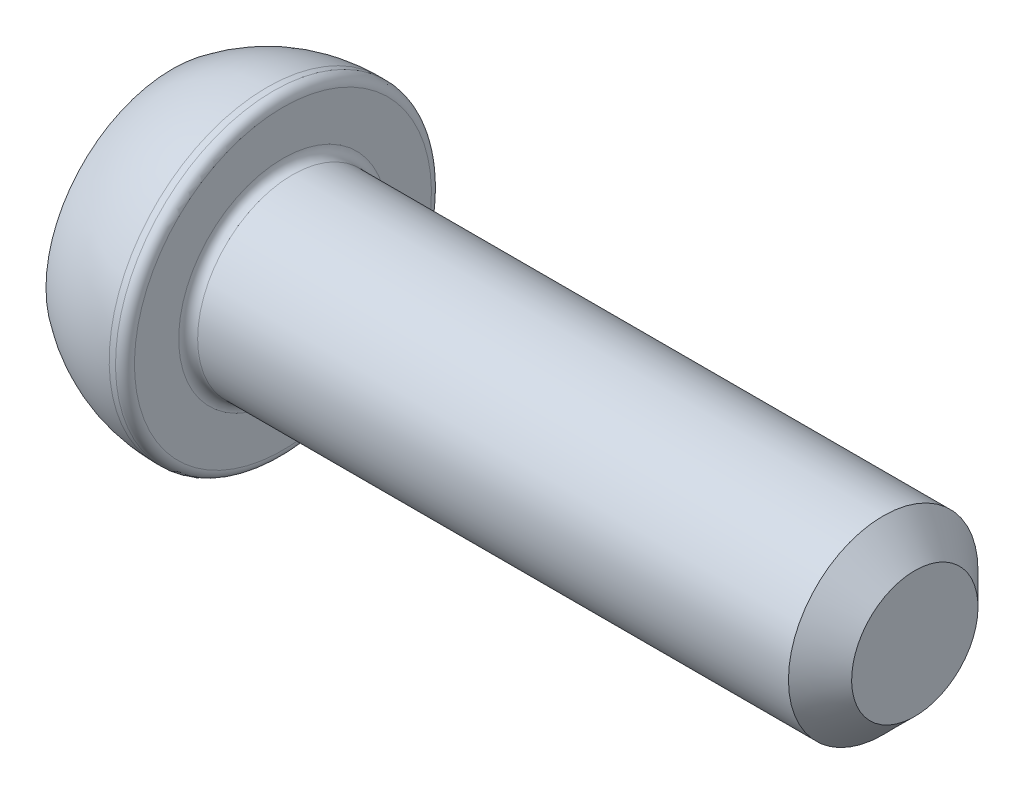
ISO-10303-21;
HEADER;
FILE_DESCRIPTION(('STEP AP214'),'2;1');
FILE_NAME('part.step','',(''),(''),'','','');
FILE_SCHEMA(('AUTOMOTIVE_DESIGN { 1 0 10303 214 1 1 1 1 }'));
ENDSEC;
DATA;
#1=APPLICATION_CONTEXT('core data for automotive mechanical design processes');
#2=APPLICATION_PROTOCOL_DEFINITION('international standard','automotive_design',2000,#1);
#3=PRODUCT_CONTEXT('',#1,'mechanical');
#4=PRODUCT('Part','Part','',(#3));
#5=PRODUCT_RELATED_PRODUCT_CATEGORY('part','',(#4));
#6=PRODUCT_DEFINITION_FORMATION('','',#4);
#7=PRODUCT_DEFINITION_CONTEXT('part definition',#1,'design');
#8=PRODUCT_DEFINITION('design','',#6,#7);
#9=PRODUCT_DEFINITION_SHAPE('','',#8);
#10=(LENGTH_UNIT() NAMED_UNIT(*) SI_UNIT(.MILLI.,.METRE.));
#11=(NAMED_UNIT(*) PLANE_ANGLE_UNIT() SI_UNIT($,.RADIAN.));
#12=(NAMED_UNIT(*) SI_UNIT($,.STERADIAN.) SOLID_ANGLE_UNIT());
#13=UNCERTAINTY_MEASURE_WITH_UNIT(LENGTH_MEASURE(1.E-05),#10,'distance_accuracy_value','');
#14=(GEOMETRIC_REPRESENTATION_CONTEXT(3) GLOBAL_UNCERTAINTY_ASSIGNED_CONTEXT((#13)) GLOBAL_UNIT_ASSIGNED_CONTEXT((#10,
#11,#12)) REPRESENTATION_CONTEXT('',''));
#15=CARTESIAN_POINT('',(0.,0.,0.));
#16=DIRECTION('',(0.,0.,1.));
#17=DIRECTION('',(1.,0.,0.));
#18=AXIS2_PLACEMENT_3D('',#15,#16,#17);
#19=CARTESIAN_POINT('',(0.,0.,0.));
#20=DIRECTION('',(-1.,0.,0.));
#21=DIRECTION('',(0.,-1.,0.));
#22=AXIS2_PLACEMENT_3D('',#19,#20,#21);
#23=PLANE('',#22);
#24=DIRECTION('',(0.,0.866025403784438,-0.5));
#25=VECTOR('',#24,1.);
#26=CARTESIAN_POINT('',(0.,0.,2.3094010767585));
#27=LINE('',#26,#25);
#28=CARTESIAN_POINT('',(0.,0.,2.3094010767585));
#29=VERTEX_POINT('',#28);
#30=CARTESIAN_POINT('',(0.,2.,1.15470053837925));
#31=VERTEX_POINT('',#30);
#32=EDGE_CURVE('E54',#29,#31,#27,.T.);
#33=ORIENTED_EDGE('',*,*,#32,.F.);
#34=DIRECTION('',(0.,0.866025403784439,0.5));
#35=VECTOR('',#34,1.);
#36=CARTESIAN_POINT('',(0.,-2.,1.15470053837925));
#37=LINE('',#36,#35);
#38=CARTESIAN_POINT('',(0.,-2.,1.15470053837925));
#39=VERTEX_POINT('',#38);
#40=EDGE_CURVE('E137',#39,#29,#37,.T.);
#41=ORIENTED_EDGE('',*,*,#40,.F.);
#42=DIRECTION('',(0.,0.,1.));
#43=VECTOR('',#42,1.);
#44=CARTESIAN_POINT('',(0.,-2.,-1.15470053837925));
#45=LINE('',#44,#43);
#46=CARTESIAN_POINT('',(0.,-2.,-1.15470053837925));
#47=VERTEX_POINT('',#46);
#48=EDGE_CURVE('E135',#47,#39,#45,.T.);
#49=ORIENTED_EDGE('',*,*,#48,.F.);
#50=DIRECTION('',(0.,-0.866025403784439,0.5));
#51=VECTOR('',#50,1.);
#52=CARTESIAN_POINT('',(0.,0.,-2.3094010767585));
#53=LINE('',#52,#51);
#54=CARTESIAN_POINT('',(0.,0.,-2.3094010767585));
#55=VERTEX_POINT('',#54);
#56=EDGE_CURVE('E102',#55,#47,#53,.T.);
#57=ORIENTED_EDGE('',*,*,#56,.F.);
#58=DIRECTION('',(0.,-0.866025403784439,-0.5));
#59=VECTOR('',#58,1.);
#60=CARTESIAN_POINT('',(0.,2.,-1.15470053837925));
#61=LINE('',#60,#59);
#62=CARTESIAN_POINT('',(0.,2.,-1.15470053837925));
#63=VERTEX_POINT('',#62);
#64=EDGE_CURVE('E131',#63,#55,#61,.T.);
#65=ORIENTED_EDGE('',*,*,#64,.F.);
#66=DIRECTION('',(0.,0.,-1.));
#67=VECTOR('',#66,1.);
#68=CARTESIAN_POINT('',(0.,2.,1.15470053837925));
#69=LINE('',#68,#67);
#70=EDGE_CURVE('E128',#31,#63,#69,.T.);
#71=ORIENTED_EDGE('',*,*,#70,.F.);
#72=EDGE_LOOP('',(#33,#41,#49,#57,#65,#71));
#73=FACE_BOUND('',#72,.T.);
#74=CARTESIAN_POINT('',(0.,0.,0.));
#75=DIRECTION('',(1.,0.,0.));
#76=DIRECTION('',(0.,1.,0.));
#77=AXIS2_PLACEMENT_3D('',#74,#75,#76);
#78=CIRCLE('',#77,4.);
#79=CARTESIAN_POINT('',(0.,4.,0.));
#80=VERTEX_POINT('',#79);
#81=EDGE_CURVE('E149',#80,#80,#78,.T.);
#82=ORIENTED_EDGE('',*,*,#81,.F.);
#83=EDGE_LOOP('',(#82));
#84=FACE_BOUND('',#83,.T.);
#85=ADVANCED_FACE('F38',(#73,#84),#23,.T.);
#86=CARTESIAN_POINT('',(3.,0.,0.));
#87=DIRECTION('',(1.,0.,0.));
#88=DIRECTION('',(0.,1.,0.));
#89=AXIS2_PLACEMENT_3D('',#86,#87,#88);
#90=SPHERICAL_SURFACE('',#89,5.);
#91=ORIENTED_EDGE('',*,*,#81,.T.);
#92=EDGE_LOOP('',(#91));
#93=FACE_BOUND('',#92,.T.);
#94=CARTESIAN_POINT('',(3.,0.,0.));
#95=DIRECTION('',(1.,0.,0.));
#96=DIRECTION('',(0.,1.,0.));
#97=AXIS2_PLACEMENT_3D('',#94,#95,#96);
#98=CIRCLE('',#97,5.);
#99=CARTESIAN_POINT('',(3.,5.,0.));
#100=VERTEX_POINT('',#99);
#101=EDGE_CURVE('E141',#100,#100,#98,.T.);
#102=ORIENTED_EDGE('',*,*,#101,.F.);
#103=EDGE_LOOP('',(#102));
#104=FACE_BOUND('',#103,.T.);
#105=ADVANCED_FACE('F178',(#93,#104),#90,.T.);
#106=CARTESIAN_POINT('',(23.5,0.,0.));
#107=DIRECTION('',(1.,0.,0.));
#108=DIRECTION('',(0.,1.,0.));
#109=AXIS2_PLACEMENT_3D('',#106,#107,#108);
#110=CYLINDRICAL_SURFACE('',#109,5.);
#111=CARTESIAN_POINT('',(3.2,0.,0.));
#112=DIRECTION('',(1.,0.,0.));
#113=DIRECTION('',(0.,1.,0.));
#114=AXIS2_PLACEMENT_3D('',#111,#112,#113);
#115=CIRCLE('',#114,5.);
#116=CARTESIAN_POINT('',(3.2,5.,0.));
#117=VERTEX_POINT('',#116);
#118=EDGE_CURVE('E161',#117,#117,#115,.F.);
#119=ORIENTED_EDGE('',*,*,#118,.T.);
#120=EDGE_LOOP('',(#119));
#121=FACE_BOUND('',#120,.T.);
#122=ORIENTED_EDGE('',*,*,#101,.T.);
#123=EDGE_LOOP('',(#122));
#124=FACE_BOUND('',#123,.T.);
#125=ADVANCED_FACE('F184',(#121,#124),#110,.T.);
#126=CARTESIAN_POINT('',(3.5,5.,0.));
#127=DIRECTION('',(1.,0.,0.));
#128=DIRECTION('',(0.,1.,0.));
#129=AXIS2_PLACEMENT_3D('',#126,#127,#128);
#130=PLANE('',#129);
#131=CARTESIAN_POINT('',(3.5,0.,0.));
#132=DIRECTION('',(1.,0.,0.));
#133=DIRECTION('',(0.,1.,0.));
#134=AXIS2_PLACEMENT_3D('',#131,#132,#133);
#135=CIRCLE('',#134,3.3);
#136=CARTESIAN_POINT('',(3.5,3.3,0.));
#137=VERTEX_POINT('',#136);
#138=EDGE_CURVE('E158',#137,#137,#135,.F.);
#139=ORIENTED_EDGE('',*,*,#138,.T.);
#140=EDGE_LOOP('',(#139));
#141=FACE_BOUND('',#140,.T.);
#142=CARTESIAN_POINT('',(3.5,0.,0.));
#143=DIRECTION('',(1.,0.,0.));
#144=DIRECTION('',(0.,1.,0.));
#145=AXIS2_PLACEMENT_3D('',#142,#143,#144);
#146=CIRCLE('',#145,4.7);
#147=CARTESIAN_POINT('',(3.5,4.7,0.));
#148=VERTEX_POINT('',#147);
#149=EDGE_CURVE('E155',#148,#148,#146,.T.);
#150=ORIENTED_EDGE('',*,*,#149,.T.);
#151=EDGE_LOOP('',(#150));
#152=FACE_BOUND('',#151,.T.);
#153=ADVANCED_FACE('F203',(#141,#152),#130,.T.);
#154=CARTESIAN_POINT('',(23.5,0.,0.));
#155=DIRECTION('',(1.,0.,0.));
#156=DIRECTION('',(0.,1.,0.));
#157=AXIS2_PLACEMENT_3D('',#154,#155,#156);
#158=CYLINDRICAL_SURFACE('',#157,3.);
#159=CARTESIAN_POINT('',(22.5,0.,0.));
#160=DIRECTION('',(1.,0.,0.));
#161=DIRECTION('',(0.,1.,0.));
#162=AXIS2_PLACEMENT_3D('',#159,#160,#161);
#163=CIRCLE('',#162,3.);
#164=CARTESIAN_POINT('',(22.5,3.,0.));
#165=VERTEX_POINT('',#164);
#166=EDGE_CURVE('E11',#165,#165,#163,.F.);
#167=ORIENTED_EDGE('',*,*,#166,.T.);
#168=EDGE_LOOP('',(#167));
#169=FACE_BOUND('',#168,.T.);
#170=CARTESIAN_POINT('',(3.8,0.,0.));
#171=DIRECTION('',(1.,0.,0.));
#172=DIRECTION('',(0.,1.,0.));
#173=AXIS2_PLACEMENT_3D('',#170,#171,#172);
#174=CIRCLE('',#173,3.);
#175=CARTESIAN_POINT('',(3.8,3.,0.));
#176=VERTEX_POINT('',#175);
#177=EDGE_CURVE('E152',#176,#176,#174,.T.);
#178=ORIENTED_EDGE('',*,*,#177,.T.);
#179=EDGE_LOOP('',(#178));
#180=FACE_BOUND('',#179,.T.);
#181=ADVANCED_FACE('F201',(#169,#180),#158,.T.);
#182=CARTESIAN_POINT('',(23.5,3.,0.));
#183=DIRECTION('',(1.,0.,0.));
#184=DIRECTION('',(0.,1.,0.));
#185=AXIS2_PLACEMENT_3D('',#182,#183,#184);
#186=PLANE('',#185);
#187=CARTESIAN_POINT('',(23.5,0.,0.));
#188=DIRECTION('',(1.,0.,0.));
#189=DIRECTION('',(0.,1.,0.));
#190=AXIS2_PLACEMENT_3D('',#187,#188,#189);
#191=CIRCLE('',#190,2.);
#192=CARTESIAN_POINT('',(23.5,2.,0.));
#193=VERTEX_POINT('',#192);
#194=EDGE_CURVE('E47',#193,#193,#191,.T.);
#195=ORIENTED_EDGE('',*,*,#194,.T.);
#196=EDGE_LOOP('',(#195));
#197=FACE_BOUND('',#196,.T.);
#198=ADVANCED_FACE('F166',(#197),#186,.T.);
#199=CARTESIAN_POINT('',(2.,0.,2.3094010767585));
#200=DIRECTION('',(0.,0.5,0.866025403784439));
#201=DIRECTION('',(0.,-0.866025403784438,0.5));
#202=AXIS2_PLACEMENT_3D('',#199,#200,#201);
#203=PLANE('',#202);
#204=ORIENTED_EDGE('',*,*,#32,.T.);
#205=DIRECTION('',(-1.,0.,0.));
#206=VECTOR('',#205,1.);
#207=CARTESIAN_POINT('',(2.,2.,1.15470053837925));
#208=LINE('',#207,#206);
#209=CARTESIAN_POINT('',(2.,2.,1.15470053837925));
#210=VERTEX_POINT('',#209);
#211=EDGE_CURVE('E84',#210,#31,#208,.T.);
#212=ORIENTED_EDGE('',*,*,#211,.F.);
#213=DIRECTION('',(0.,0.866025403784438,-0.5));
#214=VECTOR('',#213,1.);
#215=CARTESIAN_POINT('',(2.,0.,2.3094010767585));
#216=LINE('',#215,#214);
#217=CARTESIAN_POINT('',(2.,0.,2.3094010767585));
#218=VERTEX_POINT('',#217);
#219=EDGE_CURVE('E139',#218,#210,#216,.T.);
#220=ORIENTED_EDGE('',*,*,#219,.F.);
#221=DIRECTION('',(-1.,0.,0.));
#222=VECTOR('',#221,1.);
#223=CARTESIAN_POINT('',(2.,0.,2.3094010767585));
#224=LINE('',#223,#222);
#225=EDGE_CURVE('E62',#218,#29,#224,.T.);
#226=ORIENTED_EDGE('',*,*,#225,.T.);
#227=EDGE_LOOP('',(#204,#212,#220,#226));
#228=FACE_BOUND('',#227,.T.);
#229=ADVANCED_FACE('F210',(#228),#203,.F.);
#230=CARTESIAN_POINT('',(2.,-2.,1.15470053837925));
#231=DIRECTION('',(0.,-0.5,0.866025403784439));
#232=DIRECTION('',(0.,-0.866025403784439,-0.5));
#233=AXIS2_PLACEMENT_3D('',#230,#231,#232);
#234=PLANE('',#233);
#235=ORIENTED_EDGE('',*,*,#40,.T.);
#236=ORIENTED_EDGE('',*,*,#225,.F.);
#237=DIRECTION('',(0.,0.866025403784439,0.5));
#238=VECTOR('',#237,1.);
#239=CARTESIAN_POINT('',(2.,-2.,1.15470053837925));
#240=LINE('',#239,#238);
#241=CARTESIAN_POINT('',(2.,-2.,1.15470053837925));
#242=VERTEX_POINT('',#241);
#243=EDGE_CURVE('E114',#242,#218,#240,.T.);
#244=ORIENTED_EDGE('',*,*,#243,.F.);
#245=DIRECTION('',(-1.,0.,0.));
#246=VECTOR('',#245,1.);
#247=CARTESIAN_POINT('',(2.,-2.,1.15470053837925));
#248=LINE('',#247,#246);
#249=EDGE_CURVE('E106',#242,#39,#248,.T.);
#250=ORIENTED_EDGE('',*,*,#249,.T.);
#251=EDGE_LOOP('',(#235,#236,#244,#250));
#252=FACE_BOUND('',#251,.T.);
#253=ADVANCED_FACE('F269',(#252),#234,.F.);
#254=CARTESIAN_POINT('',(2.,-2.,-1.15470053837925));
#255=DIRECTION('',(0.,-1.,0.));
#256=DIRECTION('',(0.,0.,-1.));
#257=AXIS2_PLACEMENT_3D('',#254,#255,#256);
#258=PLANE('',#257);
#259=ORIENTED_EDGE('',*,*,#48,.T.);
#260=ORIENTED_EDGE('',*,*,#249,.F.);
#261=DIRECTION('',(0.,0.,1.));
#262=VECTOR('',#261,1.);
#263=CARTESIAN_POINT('',(2.,-2.,-1.15470053837925));
#264=LINE('',#263,#262);
#265=CARTESIAN_POINT('',(2.,-2.,-1.15470053837925));
#266=VERTEX_POINT('',#265);
#267=EDGE_CURVE('E110',#266,#242,#264,.T.);
#268=ORIENTED_EDGE('',*,*,#267,.F.);
#269=DIRECTION('',(-1.,0.,0.));
#270=VECTOR('',#269,1.);
#271=CARTESIAN_POINT('',(2.,-2.,-1.15470053837925));
#272=LINE('',#271,#270);
#273=EDGE_CURVE('E95',#266,#47,#272,.T.);
#274=ORIENTED_EDGE('',*,*,#273,.T.);
#275=EDGE_LOOP('',(#259,#260,#268,#274));
#276=FACE_BOUND('',#275,.T.);
#277=ADVANCED_FACE('F111',(#276),#258,.F.);
#278=CARTESIAN_POINT('',(2.,0.,-2.3094010767585));
#279=DIRECTION('',(0.,-0.5,-0.866025403784439));
#280=DIRECTION('',(0.,0.866025403784439,-0.5));
#281=AXIS2_PLACEMENT_3D('',#278,#279,#280);
#282=PLANE('',#281);
#283=ORIENTED_EDGE('',*,*,#56,.T.);
#284=ORIENTED_EDGE('',*,*,#273,.F.);
#285=DIRECTION('',(0.,-0.866025403784439,0.5));
#286=VECTOR('',#285,1.);
#287=CARTESIAN_POINT('',(2.,0.,-2.3094010767585));
#288=LINE('',#287,#286);
#289=CARTESIAN_POINT('',(2.,0.,-2.3094010767585));
#290=VERTEX_POINT('',#289);
#291=EDGE_CURVE('E99',#290,#266,#288,.T.);
#292=ORIENTED_EDGE('',*,*,#291,.F.);
#293=DIRECTION('',(-1.,0.,0.));
#294=VECTOR('',#293,1.);
#295=CARTESIAN_POINT('',(2.,0.,-2.3094010767585));
#296=LINE('',#295,#294);
#297=EDGE_CURVE('E107',#290,#55,#296,.T.);
#298=ORIENTED_EDGE('',*,*,#297,.T.);
#299=EDGE_LOOP('',(#283,#284,#292,#298));
#300=FACE_BOUND('',#299,.T.);
#301=ADVANCED_FACE('F97',(#300),#282,.F.);
#302=CARTESIAN_POINT('',(2.,2.,-1.15470053837925));
#303=DIRECTION('',(0.,0.5,-0.866025403784439));
#304=DIRECTION('',(0.,0.866025403784439,0.5));
#305=AXIS2_PLACEMENT_3D('',#302,#303,#304);
#306=PLANE('',#305);
#307=ORIENTED_EDGE('',*,*,#64,.T.);
#308=ORIENTED_EDGE('',*,*,#297,.F.);
#309=DIRECTION('',(0.,-0.866025403784439,-0.5));
#310=VECTOR('',#309,1.);
#311=CARTESIAN_POINT('',(2.,2.,-1.15470053837925));
#312=LINE('',#311,#310);
#313=CARTESIAN_POINT('',(2.,2.,-1.15470053837925));
#314=VERTEX_POINT('',#313);
#315=EDGE_CURVE('E120',#314,#290,#312,.T.);
#316=ORIENTED_EDGE('',*,*,#315,.F.);
#317=DIRECTION('',(-1.,0.,0.));
#318=VECTOR('',#317,1.);
#319=CARTESIAN_POINT('',(2.,2.,-1.15470053837925));
#320=LINE('',#319,#318);
#321=EDGE_CURVE('E144',#314,#63,#320,.T.);
#322=ORIENTED_EDGE('',*,*,#321,.T.);
#323=EDGE_LOOP('',(#307,#308,#316,#322));
#324=FACE_BOUND('',#323,.T.);
#325=ADVANCED_FACE('F286',(#324),#306,.F.);
#326=CARTESIAN_POINT('',(2.,2.,1.15470053837925));
#327=DIRECTION('',(0.,1.,0.));
#328=DIRECTION('',(0.,0.,1.));
#329=AXIS2_PLACEMENT_3D('',#326,#327,#328);
#330=PLANE('',#329);
#331=ORIENTED_EDGE('',*,*,#70,.T.);
#332=ORIENTED_EDGE('',*,*,#321,.F.);
#333=DIRECTION('',(0.,0.,-1.));
#334=VECTOR('',#333,1.);
#335=CARTESIAN_POINT('',(2.,2.,1.15470053837925));
#336=LINE('',#335,#334);
#337=EDGE_CURVE('E122',#210,#314,#336,.T.);
#338=ORIENTED_EDGE('',*,*,#337,.F.);
#339=ORIENTED_EDGE('',*,*,#211,.T.);
#340=EDGE_LOOP('',(#331,#332,#338,#339));
#341=FACE_BOUND('',#340,.T.);
#342=ADVANCED_FACE('F195',(#341),#330,.F.);
#343=CARTESIAN_POINT('',(2.,0.,0.));
#344=DIRECTION('',(-1.,0.,0.));
#345=DIRECTION('',(0.,0.,1.));
#346=AXIS2_PLACEMENT_3D('',#343,#344,#345);
#347=PLANE('',#346);
#348=ORIENTED_EDGE('',*,*,#219,.T.);
#349=ORIENTED_EDGE('',*,*,#337,.T.);
#350=ORIENTED_EDGE('',*,*,#315,.T.);
#351=ORIENTED_EDGE('',*,*,#291,.T.);
#352=ORIENTED_EDGE('',*,*,#267,.T.);
#353=ORIENTED_EDGE('',*,*,#243,.T.);
#354=EDGE_LOOP('',(#348,#349,#350,#351,#352,#353));
#355=FACE_BOUND('',#354,.T.);
#356=ADVANCED_FACE('F117',(#355),#347,.T.);
#357=CARTESIAN_POINT('',(3.8,0.,0.));
#358=DIRECTION('',(1.,0.,0.));
#359=DIRECTION('',(0.,1.,0.));
#360=AXIS2_PLACEMENT_3D('',#357,#358,#359);
#361=TOROIDAL_SURFACE('',#360,3.3,0.3);
#362=ORIENTED_EDGE('',*,*,#138,.F.);
#363=EDGE_LOOP('',(#362));
#364=FACE_BOUND('',#363,.T.);
#365=ORIENTED_EDGE('',*,*,#177,.F.);
#366=EDGE_LOOP('',(#365));
#367=FACE_BOUND('',#366,.T.);
#368=ADVANCED_FACE('F174',(#364,#367),#361,.F.);
#369=CARTESIAN_POINT('',(3.2,0.,0.));
#370=DIRECTION('',(1.,0.,0.));
#371=DIRECTION('',(0.,1.,0.));
#372=AXIS2_PLACEMENT_3D('',#369,#370,#371);
#373=TOROIDAL_SURFACE('',#372,4.7,0.3);
#374=ORIENTED_EDGE('',*,*,#118,.F.);
#375=EDGE_LOOP('',(#374));
#376=FACE_BOUND('',#375,.T.);
#377=ORIENTED_EDGE('',*,*,#149,.F.);
#378=EDGE_LOOP('',(#377));
#379=FACE_BOUND('',#378,.T.);
#380=ADVANCED_FACE('F169',(#376,#379),#373,.T.);
#381=CARTESIAN_POINT('',(23.5,0.,0.));
#382=DIRECTION('',(-1.,0.,0.));
#383=DIRECTION('',(0.,-1.,0.));
#384=AXIS2_PLACEMENT_3D('',#381,#382,#383);
#385=CONICAL_SURFACE('',#384,2.,0.785398163397447);
#386=ORIENTED_EDGE('',*,*,#166,.F.);
#387=EDGE_LOOP('',(#386));
#388=FACE_BOUND('',#387,.T.);
#389=ORIENTED_EDGE('',*,*,#194,.F.);
#390=EDGE_LOOP('',(#389));
#391=FACE_BOUND('',#390,.T.);
#392=ADVANCED_FACE('F41',(#388,#391),#385,.T.);
#393=CLOSED_SHELL('',(#85,#105,#125,#153,#181,#198,#229,#253,#277,#301,#325,#342,#356,#368,#380,#392));
#394=MANIFOLD_SOLID_BREP('B2',#393);
#395=ADVANCED_BREP_SHAPE_REPRESENTATION('',(#18,#394),#14);
#396=SHAPE_DEFINITION_REPRESENTATION(#9,#395);
ENDSEC;
END-ISO-10303-21;
